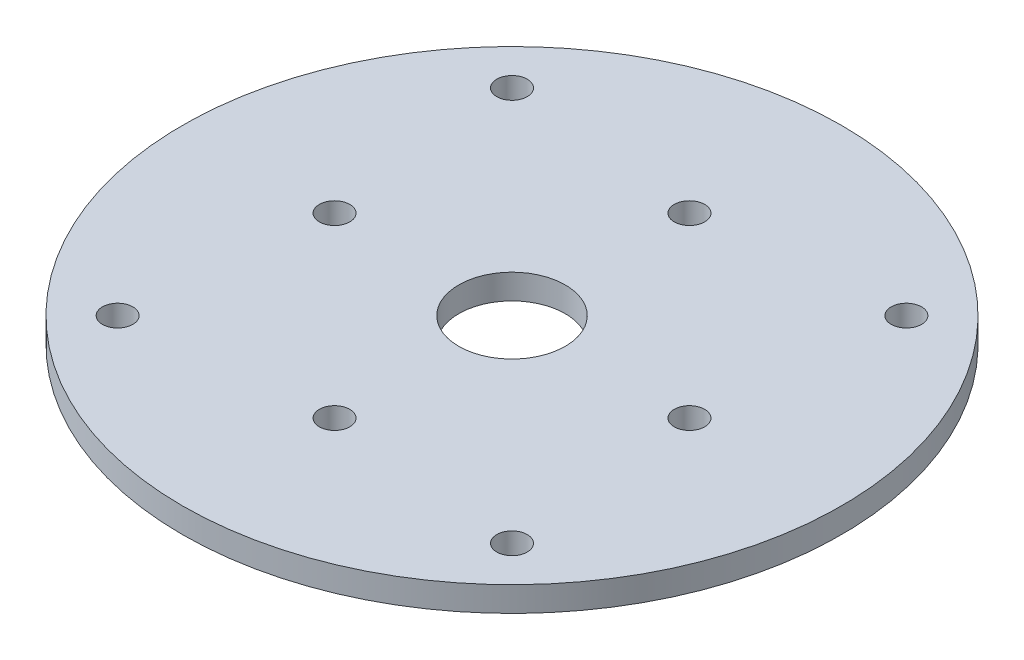
ISO-10303-21;
HEADER;
FILE_DESCRIPTION(('STEP AP214'),'2;1');
FILE_NAME('part.step','',(''),(''),'','','');
FILE_SCHEMA(('AUTOMOTIVE_DESIGN { 1 0 10303 214 1 1 1 1 }'));
ENDSEC;
DATA;
#1=APPLICATION_CONTEXT('core data for automotive mechanical design processes');
#2=APPLICATION_PROTOCOL_DEFINITION('international standard','automotive_design',2000,#1);
#3=PRODUCT_CONTEXT('',#1,'mechanical');
#4=PRODUCT('Part','Part','',(#3));
#5=PRODUCT_RELATED_PRODUCT_CATEGORY('part','',(#4));
#6=PRODUCT_DEFINITION_FORMATION('','',#4);
#7=PRODUCT_DEFINITION_CONTEXT('part definition',#1,'design');
#8=PRODUCT_DEFINITION('design','',#6,#7);
#9=PRODUCT_DEFINITION_SHAPE('','',#8);
#10=(LENGTH_UNIT() NAMED_UNIT(*) SI_UNIT(.MILLI.,.METRE.));
#11=(NAMED_UNIT(*) PLANE_ANGLE_UNIT() SI_UNIT($,.RADIAN.));
#12=(NAMED_UNIT(*) SI_UNIT($,.STERADIAN.) SOLID_ANGLE_UNIT());
#13=UNCERTAINTY_MEASURE_WITH_UNIT(LENGTH_MEASURE(1.E-05),#10,'distance_accuracy_value','');
#14=(GEOMETRIC_REPRESENTATION_CONTEXT(3) GLOBAL_UNCERTAINTY_ASSIGNED_CONTEXT((#13)) GLOBAL_UNIT_ASSIGNED_CONTEXT((#10,
#11,#12)) REPRESENTATION_CONTEXT('',''));
#15=CARTESIAN_POINT('',(0.,0.,0.));
#16=DIRECTION('',(0.,0.,1.));
#17=DIRECTION('',(1.,0.,0.));
#18=AXIS2_PLACEMENT_3D('',#15,#16,#17);
#19=CARTESIAN_POINT('',(0.,4.91700037414886,0.));
#20=DIRECTION('',(0.,-1.,0.));
#21=DIRECTION('',(0.,0.,-1.));
#22=AXIS2_PLACEMENT_3D('',#19,#20,#21);
#23=CYLINDRICAL_SURFACE('',#22,10.5);
#24=CARTESIAN_POINT('',(0.,4.91700037414886,0.));
#25=DIRECTION('',(0.,1.,0.));
#26=DIRECTION('',(0.,0.,1.));
#27=AXIS2_PLACEMENT_3D('',#24,#25,#26);
#28=CIRCLE('',#27,10.5);
#29=CARTESIAN_POINT('',(0.,4.91700037414886,10.5));
#30=VERTEX_POINT('',#29);
#31=EDGE_CURVE('E43',#30,#30,#28,.T.);
#32=ORIENTED_EDGE('',*,*,#31,.T.);
#33=EDGE_LOOP('',(#32));
#34=FACE_BOUND('',#33,.T.);
#35=CARTESIAN_POINT('',(0.,0.,0.));
#36=DIRECTION('',(0.,1.,0.));
#37=DIRECTION('',(0.,0.,1.));
#38=AXIS2_PLACEMENT_3D('',#35,#36,#37);
#39=CIRCLE('',#38,10.5);
#40=CARTESIAN_POINT('',(0.,0.,10.5));
#41=VERTEX_POINT('',#40);
#42=EDGE_CURVE('E64',#41,#41,#39,.T.);
#43=ORIENTED_EDGE('',*,*,#42,.F.);
#44=EDGE_LOOP('',(#43));
#45=FACE_BOUND('',#44,.T.);
#46=ADVANCED_FACE('F35',(#34,#45),#23,.F.);
#47=CARTESIAN_POINT('',(0.,4.91700037414886,-35.));
#48=DIRECTION('',(0.,-1.,0.));
#49=DIRECTION('',(0.,0.,-1.));
#50=AXIS2_PLACEMENT_3D('',#47,#48,#49);
#51=CYLINDRICAL_SURFACE('',#50,3.);
#52=CARTESIAN_POINT('',(0.,4.91700037414886,-35.));
#53=DIRECTION('',(0.,1.,0.));
#54=DIRECTION('',(0.,0.,1.));
#55=AXIS2_PLACEMENT_3D('',#52,#53,#54);
#56=CIRCLE('',#55,3.);
#57=CARTESIAN_POINT('',(0.,4.91700037414886,-32.));
#58=VERTEX_POINT('',#57);
#59=EDGE_CURVE('E48',#58,#58,#56,.T.);
#60=ORIENTED_EDGE('',*,*,#59,.T.);
#61=EDGE_LOOP('',(#60));
#62=FACE_BOUND('',#61,.T.);
#63=CARTESIAN_POINT('',(0.,0.,-35.));
#64=DIRECTION('',(0.,1.,0.));
#65=DIRECTION('',(0.,0.,1.));
#66=AXIS2_PLACEMENT_3D('',#63,#64,#65);
#67=CIRCLE('',#66,3.);
#68=CARTESIAN_POINT('',(0.,0.,-32.));
#69=VERTEX_POINT('',#68);
#70=EDGE_CURVE('E62',#69,#69,#67,.T.);
#71=ORIENTED_EDGE('',*,*,#70,.F.);
#72=EDGE_LOOP('',(#71));
#73=FACE_BOUND('',#72,.T.);
#74=ADVANCED_FACE('F87',(#62,#73),#51,.F.);
#75=CARTESIAN_POINT('',(0.,4.91700037414886,35.));
#76=DIRECTION('',(0.,-1.,0.));
#77=DIRECTION('',(0.,0.,-1.));
#78=AXIS2_PLACEMENT_3D('',#75,#76,#77);
#79=CYLINDRICAL_SURFACE('',#78,3.);
#80=CARTESIAN_POINT('',(0.,4.91700037414886,35.));
#81=DIRECTION('',(0.,1.,0.));
#82=DIRECTION('',(0.,0.,1.));
#83=AXIS2_PLACEMENT_3D('',#80,#81,#82);
#84=CIRCLE('',#83,3.);
#85=CARTESIAN_POINT('',(0.,4.91700037414886,38.));
#86=VERTEX_POINT('',#85);
#87=EDGE_CURVE('E78',#86,#86,#84,.T.);
#88=ORIENTED_EDGE('',*,*,#87,.T.);
#89=EDGE_LOOP('',(#88));
#90=FACE_BOUND('',#89,.T.);
#91=CARTESIAN_POINT('',(0.,0.,35.));
#92=DIRECTION('',(0.,1.,0.));
#93=DIRECTION('',(0.,0.,1.));
#94=AXIS2_PLACEMENT_3D('',#91,#92,#93);
#95=CIRCLE('',#94,3.);
#96=CARTESIAN_POINT('',(0.,0.,38.));
#97=VERTEX_POINT('',#96);
#98=EDGE_CURVE('E59',#97,#97,#95,.T.);
#99=ORIENTED_EDGE('',*,*,#98,.F.);
#100=EDGE_LOOP('',(#99));
#101=FACE_BOUND('',#100,.T.);
#102=ADVANCED_FACE('F105',(#90,#101),#79,.F.);
#103=CARTESIAN_POINT('',(35.,4.91700037414886,0.));
#104=DIRECTION('',(0.,-1.,0.));
#105=DIRECTION('',(0.,0.,-1.));
#106=AXIS2_PLACEMENT_3D('',#103,#104,#105);
#107=CYLINDRICAL_SURFACE('',#106,3.);
#108=CARTESIAN_POINT('',(35.,4.91700037414886,0.));
#109=DIRECTION('',(0.,1.,0.));
#110=DIRECTION('',(0.,0.,1.));
#111=AXIS2_PLACEMENT_3D('',#108,#109,#110);
#112=CIRCLE('',#111,3.);
#113=CARTESIAN_POINT('',(35.,4.91700037414886,3.));
#114=VERTEX_POINT('',#113);
#115=EDGE_CURVE('E73',#114,#114,#112,.T.);
#116=ORIENTED_EDGE('',*,*,#115,.T.);
#117=EDGE_LOOP('',(#116));
#118=FACE_BOUND('',#117,.T.);
#119=CARTESIAN_POINT('',(35.,0.,0.));
#120=DIRECTION('',(0.,1.,0.));
#121=DIRECTION('',(0.,0.,1.));
#122=AXIS2_PLACEMENT_3D('',#119,#120,#121);
#123=CIRCLE('',#122,3.);
#124=CARTESIAN_POINT('',(35.,0.,3.));
#125=VERTEX_POINT('',#124);
#126=EDGE_CURVE('E55',#125,#125,#123,.T.);
#127=ORIENTED_EDGE('',*,*,#126,.F.);
#128=EDGE_LOOP('',(#127));
#129=FACE_BOUND('',#128,.T.);
#130=ADVANCED_FACE('F111',(#118,#129),#107,.F.);
#131=CARTESIAN_POINT('',(-35.,4.91700037414886,0.));
#132=DIRECTION('',(0.,-1.,0.));
#133=DIRECTION('',(0.,0.,-1.));
#134=AXIS2_PLACEMENT_3D('',#131,#132,#133);
#135=CYLINDRICAL_SURFACE('',#134,3.);
#136=CARTESIAN_POINT('',(-35.,4.91700037414886,0.));
#137=DIRECTION('',(0.,1.,0.));
#138=DIRECTION('',(0.,0.,1.));
#139=AXIS2_PLACEMENT_3D('',#136,#137,#138);
#140=CIRCLE('',#139,3.);
#141=CARTESIAN_POINT('',(-35.,4.91700037414886,3.00000000000002));
#142=VERTEX_POINT('',#141);
#143=EDGE_CURVE('E69',#142,#142,#140,.T.);
#144=ORIENTED_EDGE('',*,*,#143,.T.);
#145=EDGE_LOOP('',(#144));
#146=FACE_BOUND('',#145,.T.);
#147=CARTESIAN_POINT('',(-35.,0.,0.));
#148=DIRECTION('',(0.,1.,0.));
#149=DIRECTION('',(0.,0.,1.));
#150=AXIS2_PLACEMENT_3D('',#147,#148,#149);
#151=CIRCLE('',#150,3.);
#152=CARTESIAN_POINT('',(-35.,0.,3.00000000000002));
#153=VERTEX_POINT('',#152);
#154=EDGE_CURVE('E52',#153,#153,#151,.T.);
#155=ORIENTED_EDGE('',*,*,#154,.F.);
#156=EDGE_LOOP('',(#155));
#157=FACE_BOUND('',#156,.T.);
#158=ADVANCED_FACE('F37',(#146,#157),#135,.F.);
#159=CARTESIAN_POINT('',(0.,4.91700037414886,0.));
#160=DIRECTION('',(0.,-1.,0.));
#161=DIRECTION('',(0.,0.,-1.));
#162=AXIS2_PLACEMENT_3D('',#159,#160,#161);
#163=CYLINDRICAL_SURFACE('',#162,65.);
#164=CARTESIAN_POINT('',(0.,4.91700037414886,0.));
#165=DIRECTION('',(0.,1.,0.));
#166=DIRECTION('',(0.,0.,1.));
#167=AXIS2_PLACEMENT_3D('',#164,#165,#166);
#168=CIRCLE('',#167,65.);
#169=CARTESIAN_POINT('',(0.,4.91700037414886,65.));
#170=VERTEX_POINT('',#169);
#171=EDGE_CURVE('E10',#170,#170,#168,.T.);
#172=ORIENTED_EDGE('',*,*,#171,.F.);
#173=EDGE_LOOP('',(#172));
#174=FACE_BOUND('',#173,.T.);
#175=CARTESIAN_POINT('',(0.,0.,0.));
#176=DIRECTION('',(0.,1.,0.));
#177=DIRECTION('',(0.,0.,1.));
#178=AXIS2_PLACEMENT_3D('',#175,#176,#177);
#179=CIRCLE('',#178,65.);
#180=CARTESIAN_POINT('',(0.,0.,65.));
#181=VERTEX_POINT('',#180);
#182=EDGE_CURVE('E39',#181,#181,#179,.T.);
#183=ORIENTED_EDGE('',*,*,#182,.T.);
#184=EDGE_LOOP('',(#183));
#185=FACE_BOUND('',#184,.T.);
#186=ADVANCED_FACE('F94',(#174,#185),#163,.T.);
#187=CARTESIAN_POINT('',(0.,4.91700037414886,0.));
#188=DIRECTION('',(0.,1.,0.));
#189=DIRECTION('',(0.,0.,1.));
#190=AXIS2_PLACEMENT_3D('',#187,#188,#189);
#191=PLANE('',#190);
#192=CARTESIAN_POINT('',(-38.8908729652599,4.91700037414886,38.8908729652603));
#193=DIRECTION('',(0.,1.,0.));
#194=DIRECTION('',(1.,0.,0.));
#195=AXIS2_PLACEMENT_3D('',#192,#193,#194);
#196=CIRCLE('',#195,3.);
#197=CARTESIAN_POINT('',(-35.8908729652599,4.91700037414886,38.8908729652603));
#198=VERTEX_POINT('',#197);
#199=EDGE_CURVE('E155',#198,#198,#196,.T.);
#200=ORIENTED_EDGE('',*,*,#199,.F.);
#201=EDGE_LOOP('',(#200));
#202=FACE_BOUND('',#201,.T.);
#203=CARTESIAN_POINT('',(38.8908729652602,4.91700037414886,38.89087296526));
#204=DIRECTION('',(0.,1.,0.));
#205=DIRECTION('',(0.,0.,-1.));
#206=AXIS2_PLACEMENT_3D('',#203,#204,#205);
#207=CIRCLE('',#206,3.);
#208=CARTESIAN_POINT('',(38.8908729652602,4.91700037414886,35.89087296526));
#209=VERTEX_POINT('',#208);
#210=EDGE_CURVE('E164',#209,#209,#207,.T.);
#211=ORIENTED_EDGE('',*,*,#210,.F.);
#212=EDGE_LOOP('',(#211));
#213=FACE_BOUND('',#212,.T.);
#214=CARTESIAN_POINT('',(38.8908729652596,4.91700037414886,-38.8908729652606));
#215=DIRECTION('',(0.,1.,0.));
#216=DIRECTION('',(-1.,0.,0.));
#217=AXIS2_PLACEMENT_3D('',#214,#215,#216);
#218=CIRCLE('',#217,3.);
#219=CARTESIAN_POINT('',(35.8908729652596,4.91700037414886,-38.8908729652606));
#220=VERTEX_POINT('',#219);
#221=EDGE_CURVE('E170',#220,#220,#218,.T.);
#222=ORIENTED_EDGE('',*,*,#221,.F.);
#223=EDGE_LOOP('',(#222));
#224=FACE_BOUND('',#223,.T.);
#225=CARTESIAN_POINT('',(-38.8908729652602,4.91700037414886,-38.89087296526));
#226=DIRECTION('',(0.,1.,0.));
#227=DIRECTION('',(0.,0.,1.));
#228=AXIS2_PLACEMENT_3D('',#225,#226,#227);
#229=CIRCLE('',#228,3.);
#230=CARTESIAN_POINT('',(-38.8908729652602,4.91700037414886,-35.89087296526));
#231=VERTEX_POINT('',#230);
#232=EDGE_CURVE('E56',#231,#231,#229,.T.);
#233=ORIENTED_EDGE('',*,*,#232,.F.);
#234=EDGE_LOOP('',(#233));
#235=FACE_BOUND('',#234,.T.);
#236=ORIENTED_EDGE('',*,*,#143,.F.);
#237=EDGE_LOOP('',(#236));
#238=FACE_BOUND('',#237,.T.);
#239=ORIENTED_EDGE('',*,*,#115,.F.);
#240=EDGE_LOOP('',(#239));
#241=FACE_BOUND('',#240,.T.);
#242=ORIENTED_EDGE('',*,*,#87,.F.);
#243=EDGE_LOOP('',(#242));
#244=FACE_BOUND('',#243,.T.);
#245=ORIENTED_EDGE('',*,*,#59,.F.);
#246=EDGE_LOOP('',(#245));
#247=FACE_BOUND('',#246,.T.);
#248=ORIENTED_EDGE('',*,*,#31,.F.);
#249=EDGE_LOOP('',(#248));
#250=FACE_BOUND('',#249,.T.);
#251=ORIENTED_EDGE('',*,*,#171,.T.);
#252=EDGE_LOOP('',(#251));
#253=FACE_BOUND('',#252,.T.);
#254=ADVANCED_FACE('F90',(#202,#213,#224,#235,#238,#241,#244,#247,#250,#253),#191,.T.);
#255=CARTESIAN_POINT('',(0.,0.,0.));
#256=DIRECTION('',(0.,1.,0.));
#257=DIRECTION('',(0.,0.,1.));
#258=AXIS2_PLACEMENT_3D('',#255,#256,#257);
#259=PLANE('',#258);
#260=CARTESIAN_POINT('',(-38.8908729652599,0.,38.8908729652603));
#261=DIRECTION('',(0.,1.,0.));
#262=DIRECTION('',(1.,0.,0.));
#263=AXIS2_PLACEMENT_3D('',#260,#261,#262);
#264=CIRCLE('',#263,3.);
#265=CARTESIAN_POINT('',(-35.8908729652599,0.,38.8908729652603));
#266=VERTEX_POINT('',#265);
#267=EDGE_CURVE('E157',#266,#266,#264,.T.);
#268=ORIENTED_EDGE('',*,*,#267,.T.);
#269=EDGE_LOOP('',(#268));
#270=FACE_BOUND('',#269,.T.);
#271=CARTESIAN_POINT('',(38.8908729652602,0.,38.89087296526));
#272=DIRECTION('',(0.,1.,0.));
#273=DIRECTION('',(0.,0.,-1.));
#274=AXIS2_PLACEMENT_3D('',#271,#272,#273);
#275=CIRCLE('',#274,3.);
#276=CARTESIAN_POINT('',(38.8908729652602,0.,35.89087296526));
#277=VERTEX_POINT('',#276);
#278=EDGE_CURVE('E161',#277,#277,#275,.T.);
#279=ORIENTED_EDGE('',*,*,#278,.T.);
#280=EDGE_LOOP('',(#279));
#281=FACE_BOUND('',#280,.T.);
#282=CARTESIAN_POINT('',(38.8908729652596,0.,-38.8908729652606));
#283=DIRECTION('',(0.,1.,0.));
#284=DIRECTION('',(-1.,0.,0.));
#285=AXIS2_PLACEMENT_3D('',#282,#283,#284);
#286=CIRCLE('',#285,3.);
#287=CARTESIAN_POINT('',(35.8908729652596,0.,-38.8908729652606));
#288=VERTEX_POINT('',#287);
#289=EDGE_CURVE('E167',#288,#288,#286,.T.);
#290=ORIENTED_EDGE('',*,*,#289,.T.);
#291=EDGE_LOOP('',(#290));
#292=FACE_BOUND('',#291,.T.);
#293=CARTESIAN_POINT('',(-38.8908729652602,0.,-38.89087296526));
#294=DIRECTION('',(0.,1.,0.));
#295=DIRECTION('',(0.,0.,1.));
#296=AXIS2_PLACEMENT_3D('',#293,#294,#295);
#297=CIRCLE('',#296,3.);
#298=CARTESIAN_POINT('',(-38.8908729652602,0.,-35.89087296526));
#299=VERTEX_POINT('',#298);
#300=EDGE_CURVE('E158',#299,#299,#297,.T.);
#301=ORIENTED_EDGE('',*,*,#300,.T.);
#302=EDGE_LOOP('',(#301));
#303=FACE_BOUND('',#302,.T.);
#304=ORIENTED_EDGE('',*,*,#154,.T.);
#305=EDGE_LOOP('',(#304));
#306=FACE_BOUND('',#305,.T.);
#307=ORIENTED_EDGE('',*,*,#126,.T.);
#308=EDGE_LOOP('',(#307));
#309=FACE_BOUND('',#308,.T.);
#310=ORIENTED_EDGE('',*,*,#98,.T.);
#311=EDGE_LOOP('',(#310));
#312=FACE_BOUND('',#311,.T.);
#313=ORIENTED_EDGE('',*,*,#70,.T.);
#314=EDGE_LOOP('',(#313));
#315=FACE_BOUND('',#314,.T.);
#316=ORIENTED_EDGE('',*,*,#42,.T.);
#317=EDGE_LOOP('',(#316));
#318=FACE_BOUND('',#317,.T.);
#319=ORIENTED_EDGE('',*,*,#182,.F.);
#320=EDGE_LOOP('',(#319));
#321=FACE_BOUND('',#320,.T.);
#322=ADVANCED_FACE('F93',(#270,#281,#292,#303,#306,#309,#312,#315,#318,#321),#259,.F.);
#323=CARTESIAN_POINT('',(-38.8908729652602,0.,-38.89087296526));
#324=DIRECTION('',(0.,1.,0.));
#325=DIRECTION('',(0.,0.,1.));
#326=AXIS2_PLACEMENT_3D('',#323,#324,#325);
#327=CYLINDRICAL_SURFACE('',#326,3.);
#328=ORIENTED_EDGE('',*,*,#232,.T.);
#329=EDGE_LOOP('',(#328));
#330=FACE_BOUND('',#329,.T.);
#331=ORIENTED_EDGE('',*,*,#300,.F.);
#332=EDGE_LOOP('',(#331));
#333=FACE_BOUND('',#332,.T.);
#334=ADVANCED_FACE('F124',(#330,#333),#327,.F.);
#335=CARTESIAN_POINT('',(38.8908729652596,0.,-38.8908729652606));
#336=DIRECTION('',(0.,1.,0.));
#337=DIRECTION('',(-1.,0.,0.));
#338=AXIS2_PLACEMENT_3D('',#335,#336,#337);
#339=CYLINDRICAL_SURFACE('',#338,3.);
#340=ORIENTED_EDGE('',*,*,#221,.T.);
#341=EDGE_LOOP('',(#340));
#342=FACE_BOUND('',#341,.T.);
#343=ORIENTED_EDGE('',*,*,#289,.F.);
#344=EDGE_LOOP('',(#343));
#345=FACE_BOUND('',#344,.T.);
#346=ADVANCED_FACE('F134',(#342,#345),#339,.F.);
#347=CARTESIAN_POINT('',(38.8908729652602,0.,38.89087296526));
#348=DIRECTION('',(0.,1.,0.));
#349=DIRECTION('',(0.,0.,-1.));
#350=AXIS2_PLACEMENT_3D('',#347,#348,#349);
#351=CYLINDRICAL_SURFACE('',#350,3.);
#352=ORIENTED_EDGE('',*,*,#210,.T.);
#353=EDGE_LOOP('',(#352));
#354=FACE_BOUND('',#353,.T.);
#355=ORIENTED_EDGE('',*,*,#278,.F.);
#356=EDGE_LOOP('',(#355));
#357=FACE_BOUND('',#356,.T.);
#358=ADVANCED_FACE('F142',(#354,#357),#351,.F.);
#359=CARTESIAN_POINT('',(-38.8908729652599,0.,38.8908729652603));
#360=DIRECTION('',(0.,1.,0.));
#361=DIRECTION('',(1.,0.,0.));
#362=AXIS2_PLACEMENT_3D('',#359,#360,#361);
#363=CYLINDRICAL_SURFACE('',#362,3.);
#364=ORIENTED_EDGE('',*,*,#199,.T.);
#365=EDGE_LOOP('',(#364));
#366=FACE_BOUND('',#365,.T.);
#367=ORIENTED_EDGE('',*,*,#267,.F.);
#368=EDGE_LOOP('',(#367));
#369=FACE_BOUND('',#368,.T.);
#370=ADVANCED_FACE('F146',(#366,#369),#363,.F.);
#371=CLOSED_SHELL('',(#46,#74,#102,#130,#158,#186,#254,#322,#334,#346,#358,#370));
#372=MANIFOLD_SOLID_BREP('B2',#371);
#373=ADVANCED_BREP_SHAPE_REPRESENTATION('',(#18,#372),#14);
#374=SHAPE_DEFINITION_REPRESENTATION(#9,#373);
ENDSEC;
END-ISO-10303-21;
